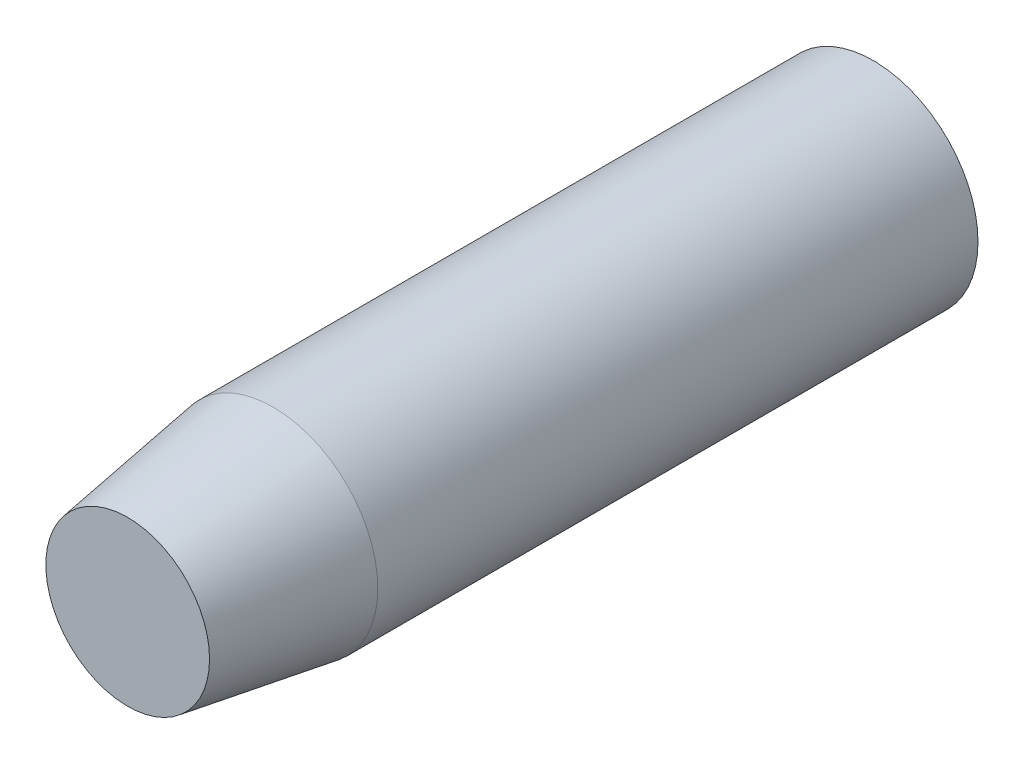
ISO-10303-21;
HEADER;
FILE_DESCRIPTION(('STEP AP214'),'2;1');
FILE_NAME('part.step','',(''),(''),'','','');
FILE_SCHEMA(('AUTOMOTIVE_DESIGN { 1 0 10303 214 1 1 1 1 }'));
ENDSEC;
DATA;
#1=APPLICATION_CONTEXT('core data for automotive mechanical design processes');
#2=APPLICATION_PROTOCOL_DEFINITION('international standard','automotive_design',2000,#1);
#3=PRODUCT_CONTEXT('',#1,'mechanical');
#4=PRODUCT('Part','Part','',(#3));
#5=PRODUCT_RELATED_PRODUCT_CATEGORY('part','',(#4));
#6=PRODUCT_DEFINITION_FORMATION('','',#4);
#7=PRODUCT_DEFINITION_CONTEXT('part definition',#1,'design');
#8=PRODUCT_DEFINITION('design','',#6,#7);
#9=PRODUCT_DEFINITION_SHAPE('','',#8);
#10=(LENGTH_UNIT() NAMED_UNIT(*) SI_UNIT(.MILLI.,.METRE.));
#11=(NAMED_UNIT(*) PLANE_ANGLE_UNIT() SI_UNIT($,.RADIAN.));
#12=(NAMED_UNIT(*) SI_UNIT($,.STERADIAN.) SOLID_ANGLE_UNIT());
#13=UNCERTAINTY_MEASURE_WITH_UNIT(LENGTH_MEASURE(1.E-05),#10,'distance_accuracy_value','');
#14=(GEOMETRIC_REPRESENTATION_CONTEXT(3) GLOBAL_UNCERTAINTY_ASSIGNED_CONTEXT((#13)) GLOBAL_UNIT_ASSIGNED_CONTEXT((#10,
#11,#12)) REPRESENTATION_CONTEXT('',''));
#15=CARTESIAN_POINT('',(0.,0.,0.));
#16=DIRECTION('',(0.,0.,1.));
#17=DIRECTION('',(1.,0.,0.));
#18=AXIS2_PLACEMENT_3D('',#15,#16,#17);
#19=CARTESIAN_POINT('',(0.,0.,65.0875));
#20=DIRECTION('',(0.,0.,-1.));
#21=DIRECTION('',(-1.,0.,0.));
#22=AXIS2_PLACEMENT_3D('',#19,#20,#21);
#23=CYLINDRICAL_SURFACE('',#22,18.25625);
#24=CARTESIAN_POINT('',(0.,0.,39.6874999999998));
#25=DIRECTION('',(0.,0.,1.));
#26=DIRECTION('',(1.,0.,0.));
#27=AXIS2_PLACEMENT_3D('',#24,#25,#26);
#28=CIRCLE('',#27,18.25625);
#29=CARTESIAN_POINT('',(18.25625,0.,39.6874999999998));
#30=VERTEX_POINT('',#29);
#31=EDGE_CURVE('E10',#30,#30,#28,.F.);
#32=ORIENTED_EDGE('',*,*,#31,.T.);
#33=EDGE_LOOP('',(#32));
#34=FACE_BOUND('',#33,.T.);
#35=CARTESIAN_POINT('',(0.,0.,-65.0875));
#36=DIRECTION('',(0.,0.,1.));
#37=DIRECTION('',(1.,0.,0.));
#38=AXIS2_PLACEMENT_3D('',#35,#36,#37);
#39=CIRCLE('',#38,18.25625);
#40=CARTESIAN_POINT('',(18.25625,0.,-65.0875));
#41=VERTEX_POINT('',#40);
#42=EDGE_CURVE('E43',#41,#41,#39,.T.);
#43=ORIENTED_EDGE('',*,*,#42,.T.);
#44=EDGE_LOOP('',(#43));
#45=FACE_BOUND('',#44,.T.);
#46=ADVANCED_FACE('F32',(#34,#45),#23,.T.);
#47=CARTESIAN_POINT('',(0.,0.,65.0875));
#48=DIRECTION('',(0.,0.,1.));
#49=DIRECTION('',(1.,0.,0.));
#50=AXIS2_PLACEMENT_3D('',#47,#48,#49);
#51=PLANE('',#50);
#52=CARTESIAN_POINT('',(0.,0.,65.0875));
#53=DIRECTION('',(0.,0.,1.));
#54=DIRECTION('',(1.,0.,0.));
#55=AXIS2_PLACEMENT_3D('',#52,#53,#54);
#56=CIRCLE('',#55,14.2875000000001);
#57=CARTESIAN_POINT('',(14.2875000000001,0.,65.0875));
#58=VERTEX_POINT('',#57);
#59=EDGE_CURVE('E39',#58,#58,#56,.T.);
#60=ORIENTED_EDGE('',*,*,#59,.T.);
#61=EDGE_LOOP('',(#60));
#62=FACE_BOUND('',#61,.T.);
#63=ADVANCED_FACE('F53',(#62),#51,.T.);
#64=CARTESIAN_POINT('',(0.,0.,-65.0875));
#65=DIRECTION('',(0.,0.,1.));
#66=DIRECTION('',(1.,0.,0.));
#67=AXIS2_PLACEMENT_3D('',#64,#65,#66);
#68=PLANE('',#67);
#69=ORIENTED_EDGE('',*,*,#42,.F.);
#70=EDGE_LOOP('',(#69));
#71=FACE_BOUND('',#70,.T.);
#72=ADVANCED_FACE('F51',(#71),#68,.F.);
#73=CARTESIAN_POINT('',(0.,0.,65.0875));
#74=DIRECTION('',(0.,0.,-1.));
#75=DIRECTION('',(-1.,0.,0.));
#76=AXIS2_PLACEMENT_3D('',#73,#74,#75);
#77=CONICAL_SURFACE('',#76,14.2875000000001,0.154996741923938);
#78=ORIENTED_EDGE('',*,*,#31,.F.);
#79=EDGE_LOOP('',(#78));
#80=FACE_BOUND('',#79,.T.);
#81=ORIENTED_EDGE('',*,*,#59,.F.);
#82=EDGE_LOOP('',(#81));
#83=FACE_BOUND('',#82,.T.);
#84=ADVANCED_FACE('F34',(#80,#83),#77,.T.);
#85=CLOSED_SHELL('',(#46,#63,#72,#84));
#86=MANIFOLD_SOLID_BREP('B2',#85);
#87=ADVANCED_BREP_SHAPE_REPRESENTATION('',(#18,#86),#14);
#88=SHAPE_DEFINITION_REPRESENTATION(#9,#87);
ENDSEC;
END-ISO-10303-21;
